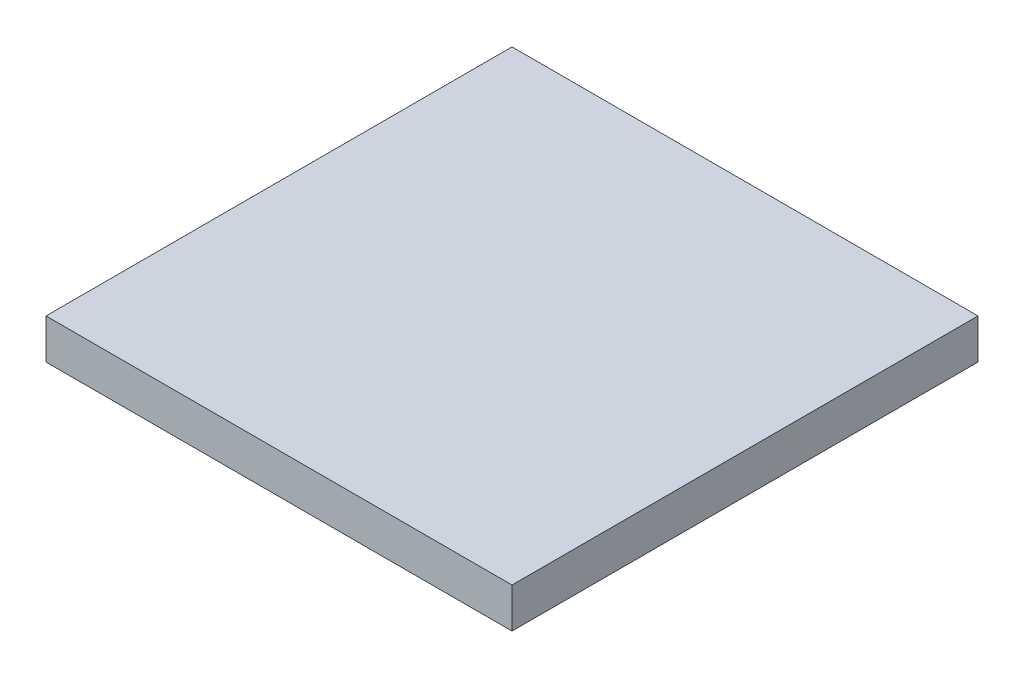
ISO-10303-21;
HEADER;
FILE_DESCRIPTION(('STEP AP214'),'2;1');
FILE_NAME('part.step','',(''),(''),'','','');
FILE_SCHEMA(('AUTOMOTIVE_DESIGN { 1 0 10303 214 1 1 1 1 }'));
ENDSEC;
DATA;
#1=APPLICATION_CONTEXT('core data for automotive mechanical design processes');
#2=APPLICATION_PROTOCOL_DEFINITION('international standard','automotive_design',2000,#1);
#3=PRODUCT_CONTEXT('',#1,'mechanical');
#4=PRODUCT('Part','Part','',(#3));
#5=PRODUCT_RELATED_PRODUCT_CATEGORY('part','',(#4));
#6=PRODUCT_DEFINITION_FORMATION('','',#4);
#7=PRODUCT_DEFINITION_CONTEXT('part definition',#1,'design');
#8=PRODUCT_DEFINITION('design','',#6,#7);
#9=PRODUCT_DEFINITION_SHAPE('','',#8);
#10=(LENGTH_UNIT() NAMED_UNIT(*) SI_UNIT(.MILLI.,.METRE.));
#11=(NAMED_UNIT(*) PLANE_ANGLE_UNIT() SI_UNIT($,.RADIAN.));
#12=(NAMED_UNIT(*) SI_UNIT($,.STERADIAN.) SOLID_ANGLE_UNIT());
#13=UNCERTAINTY_MEASURE_WITH_UNIT(LENGTH_MEASURE(1.E-05),#10,'distance_accuracy_value','');
#14=(GEOMETRIC_REPRESENTATION_CONTEXT(3) GLOBAL_UNCERTAINTY_ASSIGNED_CONTEXT((#13)) GLOBAL_UNIT_ASSIGNED_CONTEXT((#10,
#11,#12)) REPRESENTATION_CONTEXT('',''));
#15=CARTESIAN_POINT('',(0.,0.,0.));
#16=DIRECTION('',(0.,0.,1.));
#17=DIRECTION('',(1.,0.,0.));
#18=AXIS2_PLACEMENT_3D('',#15,#16,#17);
#19=CARTESIAN_POINT('',(17.5,3.,-17.5));
#20=DIRECTION('',(-1.,0.,0.));
#21=DIRECTION('',(0.,0.,1.));
#22=AXIS2_PLACEMENT_3D('',#19,#20,#21);
#23=PLANE('',#22);
#24=DIRECTION('',(0.,0.,-1.));
#25=VECTOR('',#24,1.);
#26=CARTESIAN_POINT('',(17.5,0.,-17.5));
#27=LINE('',#26,#25);
#28=CARTESIAN_POINT('',(17.5,0.,17.5));
#29=VERTEX_POINT('',#28);
#30=CARTESIAN_POINT('',(17.5,0.,-17.5));
#31=VERTEX_POINT('',#30);
#32=EDGE_CURVE('E96',#29,#31,#27,.T.);
#33=ORIENTED_EDGE('',*,*,#32,.T.);
#34=DIRECTION('',(0.,-1.,0.));
#35=VECTOR('',#34,1.);
#36=CARTESIAN_POINT('',(17.5,3.,-17.5));
#37=LINE('',#36,#35);
#38=CARTESIAN_POINT('',(17.5,3.,-17.5));
#39=VERTEX_POINT('',#38);
#40=EDGE_CURVE('E11',#39,#31,#37,.T.);
#41=ORIENTED_EDGE('',*,*,#40,.F.);
#42=DIRECTION('',(0.,0.,-1.));
#43=VECTOR('',#42,1.);
#44=CARTESIAN_POINT('',(17.5,3.,-17.5));
#45=LINE('',#44,#43);
#46=CARTESIAN_POINT('',(17.5,3.,17.5));
#47=VERTEX_POINT('',#46);
#48=EDGE_CURVE('E84',#47,#39,#45,.T.);
#49=ORIENTED_EDGE('',*,*,#48,.F.);
#50=DIRECTION('',(0.,-1.,0.));
#51=VECTOR('',#50,1.);
#52=CARTESIAN_POINT('',(17.5,3.,17.5));
#53=LINE('',#52,#51);
#54=EDGE_CURVE('E92',#47,#29,#53,.T.);
#55=ORIENTED_EDGE('',*,*,#54,.T.);
#56=EDGE_LOOP('',(#33,#41,#49,#55));
#57=FACE_BOUND('',#56,.T.);
#58=ADVANCED_FACE('F33',(#57),#23,.F.);
#59=CARTESIAN_POINT('',(-17.5,3.,-17.5));
#60=DIRECTION('',(0.,0.,1.));
#61=DIRECTION('',(1.,0.,0.));
#62=AXIS2_PLACEMENT_3D('',#59,#60,#61);
#63=PLANE('',#62);
#64=DIRECTION('',(-1.,0.,0.));
#65=VECTOR('',#64,1.);
#66=CARTESIAN_POINT('',(-17.5,0.,-17.5));
#67=LINE('',#66,#65);
#68=CARTESIAN_POINT('',(-17.5,0.,-17.5));
#69=VERTEX_POINT('',#68);
#70=EDGE_CURVE('E88',#31,#69,#67,.T.);
#71=ORIENTED_EDGE('',*,*,#70,.T.);
#72=DIRECTION('',(0.,-1.,0.));
#73=VECTOR('',#72,1.);
#74=CARTESIAN_POINT('',(-17.5,3.,-17.5));
#75=LINE('',#74,#73);
#76=CARTESIAN_POINT('',(-17.5,3.,-17.5));
#77=VERTEX_POINT('',#76);
#78=EDGE_CURVE('E41',#77,#69,#75,.T.);
#79=ORIENTED_EDGE('',*,*,#78,.F.);
#80=DIRECTION('',(-1.,0.,0.));
#81=VECTOR('',#80,1.);
#82=CARTESIAN_POINT('',(-17.5,3.,-17.5));
#83=LINE('',#82,#81);
#84=EDGE_CURVE('E79',#39,#77,#83,.T.);
#85=ORIENTED_EDGE('',*,*,#84,.F.);
#86=ORIENTED_EDGE('',*,*,#40,.T.);
#87=EDGE_LOOP('',(#71,#79,#85,#86));
#88=FACE_BOUND('',#87,.T.);
#89=ADVANCED_FACE('F87',(#88),#63,.F.);
#90=CARTESIAN_POINT('',(-17.5,3.,-17.5));
#91=DIRECTION('',(1.,0.,0.));
#92=DIRECTION('',(0.,0.,-1.));
#93=AXIS2_PLACEMENT_3D('',#90,#91,#92);
#94=PLANE('',#93);
#95=DIRECTION('',(0.,0.,1.));
#96=VECTOR('',#95,1.);
#97=CARTESIAN_POINT('',(-17.5,0.,-17.5));
#98=LINE('',#97,#96);
#99=CARTESIAN_POINT('',(-17.5,0.,17.5));
#100=VERTEX_POINT('',#99);
#101=EDGE_CURVE('E66',#69,#100,#98,.T.);
#102=ORIENTED_EDGE('',*,*,#101,.T.);
#103=DIRECTION('',(0.,-1.,0.));
#104=VECTOR('',#103,1.);
#105=CARTESIAN_POINT('',(-17.5,3.,17.5));
#106=LINE('',#105,#104);
#107=CARTESIAN_POINT('',(-17.5,3.,17.5));
#108=VERTEX_POINT('',#107);
#109=EDGE_CURVE('E89',#108,#100,#106,.T.);
#110=ORIENTED_EDGE('',*,*,#109,.F.);
#111=DIRECTION('',(0.,0.,1.));
#112=VECTOR('',#111,1.);
#113=CARTESIAN_POINT('',(-17.5,3.,-17.5));
#114=LINE('',#113,#112);
#115=EDGE_CURVE('E82',#77,#108,#114,.T.);
#116=ORIENTED_EDGE('',*,*,#115,.F.);
#117=ORIENTED_EDGE('',*,*,#78,.T.);
#118=EDGE_LOOP('',(#102,#110,#116,#117));
#119=FACE_BOUND('',#118,.T.);
#120=ADVANCED_FACE('F90',(#119),#94,.F.);
#121=CARTESIAN_POINT('',(-17.5,3.,17.5));
#122=DIRECTION('',(0.,0.,-1.));
#123=DIRECTION('',(-1.,0.,0.));
#124=AXIS2_PLACEMENT_3D('',#121,#122,#123);
#125=PLANE('',#124);
#126=DIRECTION('',(1.,0.,0.));
#127=VECTOR('',#126,1.);
#128=CARTESIAN_POINT('',(-17.5,0.,17.5));
#129=LINE('',#128,#127);
#130=EDGE_CURVE('E72',#100,#29,#129,.T.);
#131=ORIENTED_EDGE('',*,*,#130,.T.);
#132=ORIENTED_EDGE('',*,*,#54,.F.);
#133=DIRECTION('',(1.,0.,0.));
#134=VECTOR('',#133,1.);
#135=CARTESIAN_POINT('',(-17.5,3.,17.5));
#136=LINE('',#135,#134);
#137=EDGE_CURVE('E49',#108,#47,#136,.T.);
#138=ORIENTED_EDGE('',*,*,#137,.F.);
#139=ORIENTED_EDGE('',*,*,#109,.T.);
#140=EDGE_LOOP('',(#131,#132,#138,#139));
#141=FACE_BOUND('',#140,.T.);
#142=ADVANCED_FACE('F103',(#141),#125,.F.);
#143=CARTESIAN_POINT('',(0.,3.,0.));
#144=DIRECTION('',(0.,1.,0.));
#145=DIRECTION('',(0.,0.,1.));
#146=AXIS2_PLACEMENT_3D('',#143,#144,#145);
#147=PLANE('',#146);
#148=ORIENTED_EDGE('',*,*,#48,.T.);
#149=ORIENTED_EDGE('',*,*,#84,.T.);
#150=ORIENTED_EDGE('',*,*,#115,.T.);
#151=ORIENTED_EDGE('',*,*,#137,.T.);
#152=EDGE_LOOP('',(#148,#149,#150,#151));
#153=FACE_BOUND('',#152,.T.);
#154=ADVANCED_FACE('F80',(#153),#147,.T.);
#155=CARTESIAN_POINT('',(0.,0.,0.));
#156=DIRECTION('',(0.,1.,0.));
#157=DIRECTION('',(0.,0.,1.));
#158=AXIS2_PLACEMENT_3D('',#155,#156,#157);
#159=PLANE('',#158);
#160=ORIENTED_EDGE('',*,*,#32,.F.);
#161=ORIENTED_EDGE('',*,*,#130,.F.);
#162=ORIENTED_EDGE('',*,*,#101,.F.);
#163=ORIENTED_EDGE('',*,*,#70,.F.);
#164=EDGE_LOOP('',(#160,#161,#162,#163));
#165=FACE_BOUND('',#164,.T.);
#166=ADVANCED_FACE('F106',(#165),#159,.F.);
#167=CLOSED_SHELL('',(#58,#89,#120,#142,#154,#166));
#168=MANIFOLD_SOLID_BREP('B2',#167);
#169=ADVANCED_BREP_SHAPE_REPRESENTATION('',(#18,#168),#14);
#170=SHAPE_DEFINITION_REPRESENTATION(#9,#169);
ENDSEC;
END-ISO-10303-21;
